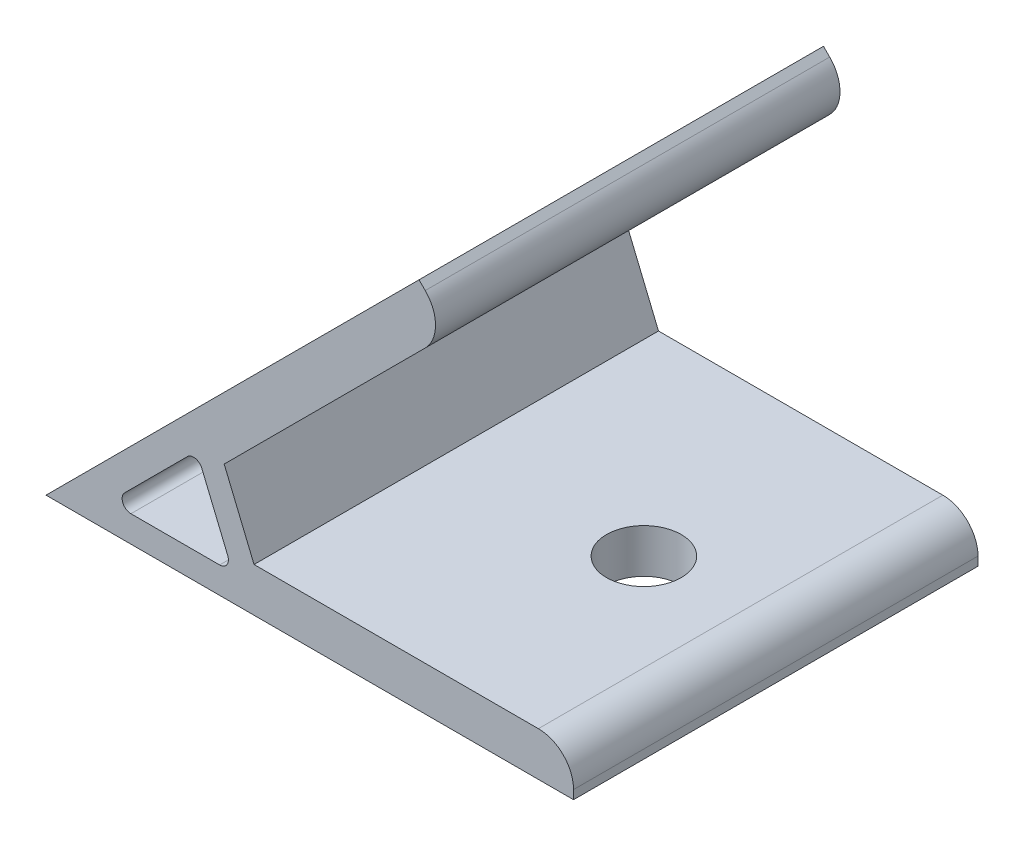
ISO-10303-21;
HEADER;
FILE_DESCRIPTION(('STEP AP214'),'2;1');
FILE_NAME('part.step','',(''),(''),'','','');
FILE_SCHEMA(('AUTOMOTIVE_DESIGN { 1 0 10303 214 1 1 1 1 }'));
ENDSEC;
DATA;
#1=APPLICATION_CONTEXT('core data for automotive mechanical design processes');
#2=APPLICATION_PROTOCOL_DEFINITION('international standard','automotive_design',2000,#1);
#3=PRODUCT_CONTEXT('',#1,'mechanical');
#4=PRODUCT('Part','Part','',(#3));
#5=PRODUCT_RELATED_PRODUCT_CATEGORY('part','',(#4));
#6=PRODUCT_DEFINITION_FORMATION('','',#4);
#7=PRODUCT_DEFINITION_CONTEXT('part definition',#1,'design');
#8=PRODUCT_DEFINITION('design','',#6,#7);
#9=PRODUCT_DEFINITION_SHAPE('','',#8);
#10=(LENGTH_UNIT() NAMED_UNIT(*) SI_UNIT(.MILLI.,.METRE.));
#11=(NAMED_UNIT(*) PLANE_ANGLE_UNIT() SI_UNIT($,.RADIAN.));
#12=(NAMED_UNIT(*) SI_UNIT($,.STERADIAN.) SOLID_ANGLE_UNIT());
#13=UNCERTAINTY_MEASURE_WITH_UNIT(LENGTH_MEASURE(1.E-05),#10,'distance_accuracy_value','');
#14=(GEOMETRIC_REPRESENTATION_CONTEXT(3) GLOBAL_UNCERTAINTY_ASSIGNED_CONTEXT((#13)) GLOBAL_UNIT_ASSIGNED_CONTEXT((#10,
#11,#12)) REPRESENTATION_CONTEXT('',''));
#15=CARTESIAN_POINT('',(0.,0.,0.));
#16=DIRECTION('',(0.,0.,1.));
#17=DIRECTION('',(1.,0.,0.));
#18=AXIS2_PLACEMENT_3D('',#15,#16,#17);
#19=CARTESIAN_POINT('',(0.,0.,23.));
#20=DIRECTION('',(0.,0.,1.));
#21=DIRECTION('',(1.,0.,0.));
#22=AXIS2_PLACEMENT_3D('',#19,#20,#21);
#23=PLANE('',#22);
#24=DIRECTION('',(0.,1.,0.));
#25=VECTOR('',#24,1.);
#26=CARTESIAN_POINT('',(60.,5.,23.));
#27=LINE('',#26,#25);
#28=CARTESIAN_POINT('',(60.,0.,23.));
#29=VERTEX_POINT('',#28);
#30=CARTESIAN_POINT('',(60.,1.,23.));
#31=VERTEX_POINT('',#30);
#32=EDGE_CURVE('E142',#29,#31,#27,.T.);
#33=ORIENTED_EDGE('',*,*,#32,.T.);
#34=CARTESIAN_POINT('',(56.,1.,23.));
#35=DIRECTION('',(0.,0.,1.));
#36=DIRECTION('',(1.,0.,0.));
#37=AXIS2_PLACEMENT_3D('',#34,#35,#36);
#38=CIRCLE('',#37,4.);
#39=CARTESIAN_POINT('',(56.,5.,23.));
#40=VERTEX_POINT('',#39);
#41=EDGE_CURVE('E184',#31,#40,#38,.T.);
#42=ORIENTED_EDGE('',*,*,#41,.T.);
#43=DIRECTION('',(-1.,0.,0.));
#44=VECTOR('',#43,1.);
#45=CARTESIAN_POINT('',(23.6613901632503,5.,23.));
#46=LINE('',#45,#44);
#47=CARTESIAN_POINT('',(23.6613901632503,5.,23.));
#48=VERTEX_POINT('',#47);
#49=EDGE_CURVE('E153',#40,#48,#46,.T.);
#50=ORIENTED_EDGE('',*,*,#49,.T.);
#51=DIRECTION('',(-0.382683432365087,0.923879532511288,0.));
#52=VECTOR('',#51,1.);
#53=CARTESIAN_POINT('',(20.2666633426678,13.1955955308021,23.));
#54=LINE('',#53,#52);
#55=CARTESIAN_POINT('',(20.2666633426678,13.1955955308021,23.));
#56=VERTEX_POINT('',#55);
#57=EDGE_CURVE('E244',#48,#56,#54,.T.);
#58=ORIENTED_EDGE('',*,*,#57,.T.);
#59=DIRECTION('',(0.707106781186551,0.707106781186544,0.));
#60=VECTOR('',#59,1.);
#61=CARTESIAN_POINT('',(45.9619407771258,38.8908729652599,23.));
#62=LINE('',#61,#60);
#63=CARTESIAN_POINT('',(43.1335136523796,36.0624458405137,23.));
#64=VERTEX_POINT('',#63);
#65=EDGE_CURVE('E246',#56,#64,#62,.T.);
#66=ORIENTED_EDGE('',*,*,#65,.T.);
#67=CARTESIAN_POINT('',(40.3050865276334,38.8908729652599,23.));
#68=DIRECTION('',(0.,0.,1.));
#69=DIRECTION('',(1.,0.,0.));
#70=AXIS2_PLACEMENT_3D('',#67,#68,#69);
#71=CIRCLE('',#70,4.);
#72=CARTESIAN_POINT('',(43.1335136523796,41.7193000900061,23.));
#73=VERTEX_POINT('',#72);
#74=EDGE_CURVE('E182',#64,#73,#71,.T.);
#75=ORIENTED_EDGE('',*,*,#74,.T.);
#76=DIRECTION('',(-0.707106781186543,0.707106781186552,0.));
#77=VECTOR('',#76,1.);
#78=CARTESIAN_POINT('',(42.4264068711931,42.4264068711926,23.));
#79=LINE('',#78,#77);
#80=CARTESIAN_POINT('',(42.4264068711931,42.4264068711926,23.));
#81=VERTEX_POINT('',#80);
#82=EDGE_CURVE('E249',#73,#81,#79,.T.);
#83=ORIENTED_EDGE('',*,*,#82,.T.);
#84=DIRECTION('',(-0.707106781186551,-0.707106781186544,0.));
#85=VECTOR('',#84,1.);
#86=CARTESIAN_POINT('',(0.,0.,23.));
#87=LINE('',#86,#85);
#88=CARTESIAN_POINT('',(0.,0.,23.));
#89=VERTEX_POINT('',#88);
#90=EDGE_CURVE('E158',#81,#89,#87,.T.);
#91=ORIENTED_EDGE('',*,*,#90,.T.);
#92=DIRECTION('',(1.,0.,0.));
#93=VECTOR('',#92,1.);
#94=CARTESIAN_POINT('',(60.,0.,23.));
#95=LINE('',#94,#93);
#96=EDGE_CURVE('E154',#89,#29,#95,.T.);
#97=ORIENTED_EDGE('',*,*,#96,.T.);
#98=EDGE_LOOP('',(#33,#42,#50,#58,#66,#75,#83,#91,#97));
#99=FACE_BOUND('',#98,.T.);
#100=DIRECTION('',(1.,0.,0.));
#101=VECTOR('',#100,1.);
#102=CARTESIAN_POINT('',(21.2426406871194,3.,23.));
#103=LINE('',#102,#101);
#104=CARTESIAN_POINT('',(9.65685424949248,3.,23.));
#105=VERTEX_POINT('',#104);
#106=CARTESIAN_POINT('',(19.7460349244539,3.,23.));
#107=VERTEX_POINT('',#106);
#108=EDGE_CURVE('E229',#105,#107,#103,.T.);
#109=ORIENTED_EDGE('',*,*,#108,.F.);
#110=CARTESIAN_POINT('',(9.65685424949247,4.,23.));
#111=DIRECTION('',(0.,0.,1.));
#112=DIRECTION('',(1.,0.,0.));
#113=AXIS2_PLACEMENT_3D('',#110,#111,#112);
#114=CIRCLE('',#113,1.);
#115=CARTESIAN_POINT('',(8.94974746830593,4.70710678118655,23.));
#116=VERTEX_POINT('',#115);
#117=EDGE_CURVE('E211',#105,#116,#114,.F.);
#118=ORIENTED_EDGE('',*,*,#117,.T.);
#119=DIRECTION('',(-0.707106781186551,-0.707106781186544,0.));
#120=VECTOR('',#119,1.);
#121=CARTESIAN_POINT('',(7.24264068711936,3.,23.));
#122=LINE('',#121,#120);
#123=CARTESIAN_POINT('',(16.0838755401874,11.841234853068,23.));
#124=VERTEX_POINT('',#123);
#125=EDGE_CURVE('E226',#124,#116,#122,.T.);
#126=ORIENTED_EDGE('',*,*,#125,.F.);
#127=CARTESIAN_POINT('',(16.790982321374,11.1341280718814,23.));
#128=DIRECTION('',(0.,0.,1.));
#129=DIRECTION('',(1.,0.,0.));
#130=AXIS2_PLACEMENT_3D('',#127,#128,#129);
#131=CIRCLE('',#130,1.);
#132=CARTESIAN_POINT('',(17.7148618538853,11.5168115042465,23.));
#133=VERTEX_POINT('',#132);
#134=EDGE_CURVE('E207',#124,#133,#131,.F.);
#135=ORIENTED_EDGE('',*,*,#134,.T.);
#136=DIRECTION('',(-0.382683432365087,0.923879532511288,0.));
#137=VECTOR('',#136,1.);
#138=CARTESIAN_POINT('',(17.1421356237311,12.8994949366116,23.));
#139=LINE('',#138,#137);
#140=CARTESIAN_POINT('',(20.6699144569652,4.38268343236509,23.));
#141=VERTEX_POINT('',#140);
#142=EDGE_CURVE('E231',#141,#133,#139,.T.);
#143=ORIENTED_EDGE('',*,*,#142,.F.);
#144=CARTESIAN_POINT('',(19.7460349244539,4.,23.));
#145=DIRECTION('',(0.,0.,1.));
#146=DIRECTION('',(1.,0.,0.));
#147=AXIS2_PLACEMENT_3D('',#144,#145,#146);
#148=CIRCLE('',#147,1.);
#149=EDGE_CURVE('E11',#141,#107,#148,.F.);
#150=ORIENTED_EDGE('',*,*,#149,.T.);
#151=EDGE_LOOP('',(#109,#118,#126,#135,#143,#150));
#152=FACE_BOUND('',#151,.T.);
#153=ADVANCED_FACE('F35',(#99,#152),#23,.T.);
#154=CARTESIAN_POINT('',(0.,0.,-23.));
#155=DIRECTION('',(0.,0.,1.));
#156=DIRECTION('',(1.,0.,0.));
#157=AXIS2_PLACEMENT_3D('',#154,#155,#156);
#158=PLANE('',#157);
#159=DIRECTION('',(-1.,0.,0.));
#160=VECTOR('',#159,1.);
#161=CARTESIAN_POINT('',(23.6613901632503,5.,-23.));
#162=LINE('',#161,#160);
#163=CARTESIAN_POINT('',(56.,5.,-23.));
#164=VERTEX_POINT('',#163);
#165=CARTESIAN_POINT('',(23.6613901632503,5.,-23.));
#166=VERTEX_POINT('',#165);
#167=EDGE_CURVE('E256',#164,#166,#162,.T.);
#168=ORIENTED_EDGE('',*,*,#167,.F.);
#169=CARTESIAN_POINT('',(56.,1.,-23.));
#170=DIRECTION('',(0.,0.,1.));
#171=DIRECTION('',(1.,0.,0.));
#172=AXIS2_PLACEMENT_3D('',#169,#170,#171);
#173=CIRCLE('',#172,4.);
#174=CARTESIAN_POINT('',(60.,1.,-23.));
#175=VERTEX_POINT('',#174);
#176=EDGE_CURVE('E179',#164,#175,#173,.F.);
#177=ORIENTED_EDGE('',*,*,#176,.T.);
#178=DIRECTION('',(0.,1.,0.));
#179=VECTOR('',#178,1.);
#180=CARTESIAN_POINT('',(60.,5.,-23.));
#181=LINE('',#180,#179);
#182=CARTESIAN_POINT('',(60.,0.,-23.));
#183=VERTEX_POINT('',#182);
#184=EDGE_CURVE('E254',#183,#175,#181,.T.);
#185=ORIENTED_EDGE('',*,*,#184,.F.);
#186=DIRECTION('',(1.,0.,0.));
#187=VECTOR('',#186,1.);
#188=CARTESIAN_POINT('',(60.,0.,-23.));
#189=LINE('',#188,#187);
#190=CARTESIAN_POINT('',(0.,0.,-23.));
#191=VERTEX_POINT('',#190);
#192=EDGE_CURVE('E166',#191,#183,#189,.T.);
#193=ORIENTED_EDGE('',*,*,#192,.F.);
#194=DIRECTION('',(-0.707106781186551,-0.707106781186544,0.));
#195=VECTOR('',#194,1.);
#196=CARTESIAN_POINT('',(0.,0.,-23.));
#197=LINE('',#196,#195);
#198=CARTESIAN_POINT('',(42.4264068711931,42.4264068711926,-23.));
#199=VERTEX_POINT('',#198);
#200=EDGE_CURVE('E162',#199,#191,#197,.T.);
#201=ORIENTED_EDGE('',*,*,#200,.F.);
#202=DIRECTION('',(-0.707106781186543,0.707106781186552,0.));
#203=VECTOR('',#202,1.);
#204=CARTESIAN_POINT('',(42.4264068711931,42.4264068711926,-23.));
#205=LINE('',#204,#203);
#206=CARTESIAN_POINT('',(43.1335136523796,41.7193000900061,-23.));
#207=VERTEX_POINT('',#206);
#208=EDGE_CURVE('E263',#207,#199,#205,.T.);
#209=ORIENTED_EDGE('',*,*,#208,.F.);
#210=CARTESIAN_POINT('',(40.3050865276334,38.8908729652599,-23.));
#211=DIRECTION('',(0.,0.,1.));
#212=DIRECTION('',(1.,0.,0.));
#213=AXIS2_PLACEMENT_3D('',#210,#211,#212);
#214=CIRCLE('',#213,4.);
#215=CARTESIAN_POINT('',(43.1335136523796,36.0624458405137,-23.));
#216=VERTEX_POINT('',#215);
#217=EDGE_CURVE('E171',#207,#216,#214,.F.);
#218=ORIENTED_EDGE('',*,*,#217,.T.);
#219=DIRECTION('',(0.707106781186551,0.707106781186544,0.));
#220=VECTOR('',#219,1.);
#221=CARTESIAN_POINT('',(45.9619407771258,38.8908729652599,-23.));
#222=LINE('',#221,#220);
#223=CARTESIAN_POINT('',(20.2666633426678,13.1955955308021,-23.));
#224=VERTEX_POINT('',#223);
#225=EDGE_CURVE('E260',#224,#216,#222,.T.);
#226=ORIENTED_EDGE('',*,*,#225,.F.);
#227=DIRECTION('',(-0.382683432365087,0.923879532511288,0.));
#228=VECTOR('',#227,1.);
#229=CARTESIAN_POINT('',(20.2666633426678,13.1955955308021,-23.));
#230=LINE('',#229,#228);
#231=EDGE_CURVE('E258',#166,#224,#230,.T.);
#232=ORIENTED_EDGE('',*,*,#231,.F.);
#233=EDGE_LOOP('',(#168,#177,#185,#193,#201,#209,#218,#226,#232));
#234=FACE_BOUND('',#233,.T.);
#235=DIRECTION('',(-0.382683432365087,0.923879532511288,0.));
#236=VECTOR('',#235,1.);
#237=CARTESIAN_POINT('',(17.1421356237311,12.8994949366116,-23.));
#238=LINE('',#237,#236);
#239=CARTESIAN_POINT('',(20.6699144569652,4.38268343236509,-23.));
#240=VERTEX_POINT('',#239);
#241=CARTESIAN_POINT('',(17.7148618538853,11.5168115042465,-23.));
#242=VERTEX_POINT('',#241);
#243=EDGE_CURVE('E217',#240,#242,#238,.T.);
#244=ORIENTED_EDGE('',*,*,#243,.T.);
#245=CARTESIAN_POINT('',(16.790982321374,11.1341280718814,-23.));
#246=DIRECTION('',(0.,0.,1.));
#247=DIRECTION('',(1.,0.,0.));
#248=AXIS2_PLACEMENT_3D('',#245,#246,#247);
#249=CIRCLE('',#248,1.);
#250=CARTESIAN_POINT('',(16.0838755401874,11.841234853068,-23.));
#251=VERTEX_POINT('',#250);
#252=EDGE_CURVE('E205',#242,#251,#249,.T.);
#253=ORIENTED_EDGE('',*,*,#252,.T.);
#254=DIRECTION('',(-0.707106781186551,-0.707106781186544,0.));
#255=VECTOR('',#254,1.);
#256=CARTESIAN_POINT('',(7.24264068711936,3.,-23.));
#257=LINE('',#256,#255);
#258=CARTESIAN_POINT('',(8.94974746830593,4.70710678118655,-23.));
#259=VERTEX_POINT('',#258);
#260=EDGE_CURVE('E238',#251,#259,#257,.T.);
#261=ORIENTED_EDGE('',*,*,#260,.T.);
#262=CARTESIAN_POINT('',(9.65685424949247,4.,-23.));
#263=DIRECTION('',(0.,0.,1.));
#264=DIRECTION('',(1.,0.,0.));
#265=AXIS2_PLACEMENT_3D('',#262,#263,#264);
#266=CIRCLE('',#265,1.);
#267=CARTESIAN_POINT('',(9.65685424949248,3.,-23.));
#268=VERTEX_POINT('',#267);
#269=EDGE_CURVE('E209',#259,#268,#266,.T.);
#270=ORIENTED_EDGE('',*,*,#269,.T.);
#271=DIRECTION('',(1.,0.,0.));
#272=VECTOR('',#271,1.);
#273=CARTESIAN_POINT('',(21.2426406871194,3.,-23.));
#274=LINE('',#273,#272);
#275=CARTESIAN_POINT('',(19.7460349244539,3.,-23.));
#276=VERTEX_POINT('',#275);
#277=EDGE_CURVE('E218',#268,#276,#274,.T.);
#278=ORIENTED_EDGE('',*,*,#277,.T.);
#279=CARTESIAN_POINT('',(19.7460349244539,4.,-23.));
#280=DIRECTION('',(0.,0.,1.));
#281=DIRECTION('',(1.,0.,0.));
#282=AXIS2_PLACEMENT_3D('',#279,#280,#281);
#283=CIRCLE('',#282,1.);
#284=EDGE_CURVE('E43',#276,#240,#283,.T.);
#285=ORIENTED_EDGE('',*,*,#284,.T.);
#286=EDGE_LOOP('',(#244,#253,#261,#270,#278,#285));
#287=FACE_BOUND('',#286,.T.);
#288=ADVANCED_FACE('F216',(#234,#287),#158,.F.);
#289=CARTESIAN_POINT('',(60.,0.,23.));
#290=DIRECTION('',(0.,1.,0.));
#291=DIRECTION('',(0.,0.,1.));
#292=AXIS2_PLACEMENT_3D('',#289,#290,#291);
#293=PLANE('',#292);
#294=CARTESIAN_POINT('',(45.,0.,0.));
#295=DIRECTION('',(0.,-1.,0.));
#296=DIRECTION('',(0.,0.,-1.));
#297=AXIS2_PLACEMENT_3D('',#294,#295,#296);
#298=CIRCLE('',#297,4.25000000000001);
#299=CARTESIAN_POINT('',(45.,0.,-4.25000000000001));
#300=VERTEX_POINT('',#299);
#301=EDGE_CURVE('E343',#300,#300,#298,.T.);
#302=ORIENTED_EDGE('',*,*,#301,.F.);
#303=EDGE_LOOP('',(#302));
#304=FACE_BOUND('',#303,.T.);
#305=ORIENTED_EDGE('',*,*,#192,.T.);
#306=DIRECTION('',(0.,0.,-1.));
#307=VECTOR('',#306,1.);
#308=CARTESIAN_POINT('',(60.,0.,23.));
#309=LINE('',#308,#307);
#310=EDGE_CURVE('E147',#29,#183,#309,.T.);
#311=ORIENTED_EDGE('',*,*,#310,.F.);
#312=ORIENTED_EDGE('',*,*,#96,.F.);
#313=DIRECTION('',(0.,0.,-1.));
#314=VECTOR('',#313,1.);
#315=CARTESIAN_POINT('',(0.,0.,23.));
#316=LINE('',#315,#314);
#317=EDGE_CURVE('E252',#89,#191,#316,.T.);
#318=ORIENTED_EDGE('',*,*,#317,.T.);
#319=EDGE_LOOP('',(#305,#311,#312,#318));
#320=FACE_BOUND('',#319,.T.);
#321=ADVANCED_FACE('F164',(#304,#320),#293,.F.);
#322=CARTESIAN_POINT('',(60.,5.,23.));
#323=DIRECTION('',(-1.,0.,0.));
#324=DIRECTION('',(0.,0.,1.));
#325=AXIS2_PLACEMENT_3D('',#322,#323,#324);
#326=PLANE('',#325);
#327=ORIENTED_EDGE('',*,*,#184,.T.);
#328=DIRECTION('',(0.,0.,-1.));
#329=VECTOR('',#328,1.);
#330=CARTESIAN_POINT('',(60.,1.,23.));
#331=LINE('',#330,#329);
#332=EDGE_CURVE('E150',#175,#31,#331,.F.);
#333=ORIENTED_EDGE('',*,*,#332,.T.);
#334=ORIENTED_EDGE('',*,*,#32,.F.);
#335=ORIENTED_EDGE('',*,*,#310,.T.);
#336=EDGE_LOOP('',(#327,#333,#334,#335));
#337=FACE_BOUND('',#336,.T.);
#338=ADVANCED_FACE('F145',(#337),#326,.F.);
#339=CARTESIAN_POINT('',(23.6613901632503,5.,23.));
#340=DIRECTION('',(0.,-1.,0.));
#341=DIRECTION('',(0.,0.,-1.));
#342=AXIS2_PLACEMENT_3D('',#339,#340,#341);
#343=PLANE('',#342);
#344=CARTESIAN_POINT('',(45.,5.,0.));
#345=DIRECTION('',(0.,-1.,0.));
#346=DIRECTION('',(0.,0.,-1.));
#347=AXIS2_PLACEMENT_3D('',#344,#345,#346);
#348=CIRCLE('',#347,4.25000000000001);
#349=CARTESIAN_POINT('',(45.,5.,-4.25000000000001));
#350=VERTEX_POINT('',#349);
#351=EDGE_CURVE('E345',#350,#350,#348,.F.);
#352=ORIENTED_EDGE('',*,*,#351,.F.);
#353=EDGE_LOOP('',(#352));
#354=FACE_BOUND('',#353,.T.);
#355=ORIENTED_EDGE('',*,*,#49,.F.);
#356=DIRECTION('',(0.,0.,-1.));
#357=VECTOR('',#356,1.);
#358=CARTESIAN_POINT('',(56.,5.,23.));
#359=LINE('',#358,#357);
#360=EDGE_CURVE('E167',#40,#164,#359,.T.);
#361=ORIENTED_EDGE('',*,*,#360,.T.);
#362=ORIENTED_EDGE('',*,*,#167,.T.);
#363=DIRECTION('',(0.,0.,-1.));
#364=VECTOR('',#363,1.);
#365=CARTESIAN_POINT('',(23.6613901632503,5.,23.));
#366=LINE('',#365,#364);
#367=EDGE_CURVE('E168',#48,#166,#366,.T.);
#368=ORIENTED_EDGE('',*,*,#367,.F.);
#369=EDGE_LOOP('',(#355,#361,#362,#368));
#370=FACE_BOUND('',#369,.T.);
#371=ADVANCED_FACE('F295',(#354,#370),#343,.F.);
#372=CARTESIAN_POINT('',(20.2666633426678,13.1955955308021,23.));
#373=DIRECTION('',(-0.923879532511288,-0.382683432365087,0.));
#374=DIRECTION('',(0.382683432365087,-0.923879532511288,0.));
#375=AXIS2_PLACEMENT_3D('',#372,#373,#374);
#376=PLANE('',#375);
#377=ORIENTED_EDGE('',*,*,#231,.T.);
#378=DIRECTION('',(0.,0.,-1.));
#379=VECTOR('',#378,1.);
#380=CARTESIAN_POINT('',(20.2666633426678,13.1955955308021,23.));
#381=LINE('',#380,#379);
#382=EDGE_CURVE('E174',#56,#224,#381,.T.);
#383=ORIENTED_EDGE('',*,*,#382,.F.);
#384=ORIENTED_EDGE('',*,*,#57,.F.);
#385=ORIENTED_EDGE('',*,*,#367,.T.);
#386=EDGE_LOOP('',(#377,#383,#384,#385));
#387=FACE_BOUND('',#386,.T.);
#388=ADVANCED_FACE('F293',(#387),#376,.F.);
#389=CARTESIAN_POINT('',(45.9619407771258,38.8908729652599,23.));
#390=DIRECTION('',(-0.707106781186544,0.707106781186551,0.));
#391=DIRECTION('',(-0.707106781186551,-0.707106781186544,0.));
#392=AXIS2_PLACEMENT_3D('',#389,#390,#391);
#393=PLANE('',#392);
#394=CARTESIAN_POINT('',(35.3553390593275,28.2842712474617,0.));
#395=DIRECTION('',(-0.707106781186544,0.707106781186551,0.));
#396=DIRECTION('',(-0.707106781186551,-0.707106781186544,0.));
#397=AXIS2_PLACEMENT_3D('',#394,#395,#396);
#398=CIRCLE('',#397,4.25);
#399=CARTESIAN_POINT('',(32.3501352392847,25.2790674274189,0.));
#400=VERTEX_POINT('',#399);
#401=EDGE_CURVE('E241',#400,#400,#398,.F.);
#402=ORIENTED_EDGE('',*,*,#401,.F.);
#403=EDGE_LOOP('',(#402));
#404=FACE_BOUND('',#403,.T.);
#405=ORIENTED_EDGE('',*,*,#225,.T.);
#406=DIRECTION('',(0.,0.,-1.));
#407=VECTOR('',#406,1.);
#408=CARTESIAN_POINT('',(43.1335136523796,36.0624458405137,23.));
#409=LINE('',#408,#407);
#410=EDGE_CURVE('E189',#216,#64,#409,.F.);
#411=ORIENTED_EDGE('',*,*,#410,.T.);
#412=ORIENTED_EDGE('',*,*,#65,.F.);
#413=ORIENTED_EDGE('',*,*,#382,.T.);
#414=EDGE_LOOP('',(#405,#411,#412,#413));
#415=FACE_BOUND('',#414,.T.);
#416=ADVANCED_FACE('F274',(#404,#415),#393,.F.);
#417=CARTESIAN_POINT('',(42.4264068711931,42.4264068711926,23.));
#418=DIRECTION('',(-0.707106781186552,-0.707106781186543,0.));
#419=DIRECTION('',(0.707106781186543,-0.707106781186552,0.));
#420=AXIS2_PLACEMENT_3D('',#417,#418,#419);
#421=PLANE('',#420);
#422=ORIENTED_EDGE('',*,*,#82,.F.);
#423=DIRECTION('',(0.,0.,-1.));
#424=VECTOR('',#423,1.);
#425=CARTESIAN_POINT('',(43.1335136523796,41.7193000900061,23.));
#426=LINE('',#425,#424);
#427=EDGE_CURVE('E186',#73,#207,#426,.T.);
#428=ORIENTED_EDGE('',*,*,#427,.T.);
#429=ORIENTED_EDGE('',*,*,#208,.T.);
#430=DIRECTION('',(0.,0.,-1.));
#431=VECTOR('',#430,1.);
#432=CARTESIAN_POINT('',(42.4264068711931,42.4264068711926,23.));
#433=LINE('',#432,#431);
#434=EDGE_CURVE('E267',#81,#199,#433,.T.);
#435=ORIENTED_EDGE('',*,*,#434,.F.);
#436=EDGE_LOOP('',(#422,#428,#429,#435));
#437=FACE_BOUND('',#436,.T.);
#438=ADVANCED_FACE('F289',(#437),#421,.F.);
#439=CARTESIAN_POINT('',(0.,0.,23.));
#440=DIRECTION('',(0.707106781186544,-0.707106781186551,0.));
#441=DIRECTION('',(0.707106781186551,0.707106781186544,0.));
#442=AXIS2_PLACEMENT_3D('',#439,#440,#441);
#443=PLANE('',#442);
#444=CARTESIAN_POINT('',(31.8198051533948,31.8198051533945,0.));
#445=DIRECTION('',(-0.707106781186544,0.707106781186551,0.));
#446=DIRECTION('',(-0.707106781186551,-0.707106781186544,0.));
#447=AXIS2_PLACEMENT_3D('',#444,#445,#446);
#448=CIRCLE('',#447,4.25);
#449=CARTESIAN_POINT('',(28.814601333352,28.8146013333516,0.));
#450=VERTEX_POINT('',#449);
#451=EDGE_CURVE('E348',#450,#450,#448,.T.);
#452=ORIENTED_EDGE('',*,*,#451,.F.);
#453=EDGE_LOOP('',(#452));
#454=FACE_BOUND('',#453,.T.);
#455=ORIENTED_EDGE('',*,*,#200,.T.);
#456=ORIENTED_EDGE('',*,*,#317,.F.);
#457=ORIENTED_EDGE('',*,*,#90,.F.);
#458=ORIENTED_EDGE('',*,*,#434,.T.);
#459=EDGE_LOOP('',(#455,#456,#457,#458));
#460=FACE_BOUND('',#459,.T.);
#461=ADVANCED_FACE('F322',(#454,#460),#443,.F.);
#462=CARTESIAN_POINT('',(7.24264068711936,3.,23.));
#463=DIRECTION('',(0.707106781186544,-0.707106781186551,0.));
#464=DIRECTION('',(0.707106781186551,0.707106781186544,0.));
#465=AXIS2_PLACEMENT_3D('',#462,#463,#464);
#466=PLANE('',#465);
#467=ORIENTED_EDGE('',*,*,#260,.F.);
#468=DIRECTION('',(0.,0.,-1.));
#469=VECTOR('',#468,1.);
#470=CARTESIAN_POINT('',(16.0838755401874,11.841234853068,23.));
#471=LINE('',#470,#469);
#472=EDGE_CURVE('E199',#251,#124,#471,.F.);
#473=ORIENTED_EDGE('',*,*,#472,.T.);
#474=ORIENTED_EDGE('',*,*,#125,.T.);
#475=DIRECTION('',(0.,0.,-1.));
#476=VECTOR('',#475,1.);
#477=CARTESIAN_POINT('',(8.94974746830593,4.70710678118655,-23.));
#478=LINE('',#477,#476);
#479=EDGE_CURVE('E196',#116,#259,#478,.T.);
#480=ORIENTED_EDGE('',*,*,#479,.T.);
#481=EDGE_LOOP('',(#467,#473,#474,#480));
#482=FACE_BOUND('',#481,.T.);
#483=ADVANCED_FACE('F319',(#482),#466,.T.);
#484=CARTESIAN_POINT('',(21.2426406871194,3.,23.));
#485=DIRECTION('',(0.,1.,0.));
#486=DIRECTION('',(0.,0.,1.));
#487=AXIS2_PLACEMENT_3D('',#484,#485,#486);
#488=PLANE('',#487);
#489=ORIENTED_EDGE('',*,*,#277,.F.);
#490=DIRECTION('',(0.,0.,-1.));
#491=VECTOR('',#490,1.);
#492=CARTESIAN_POINT('',(9.65685424949247,3.,23.));
#493=LINE('',#492,#491);
#494=EDGE_CURVE('E55',#268,#105,#493,.F.);
#495=ORIENTED_EDGE('',*,*,#494,.T.);
#496=ORIENTED_EDGE('',*,*,#108,.T.);
#497=DIRECTION('',(0.,0.,-1.));
#498=VECTOR('',#497,1.);
#499=CARTESIAN_POINT('',(19.7460349244539,3.,-23.));
#500=LINE('',#499,#498);
#501=EDGE_CURVE('E201',#107,#276,#500,.T.);
#502=ORIENTED_EDGE('',*,*,#501,.T.);
#503=EDGE_LOOP('',(#489,#495,#496,#502));
#504=FACE_BOUND('',#503,.T.);
#505=ADVANCED_FACE('F228',(#504),#488,.T.);
#506=CARTESIAN_POINT('',(17.1421356237311,12.8994949366116,23.));
#507=DIRECTION('',(-0.923879532511288,-0.382683432365087,0.));
#508=DIRECTION('',(0.382683432365087,-0.923879532511288,0.));
#509=AXIS2_PLACEMENT_3D('',#506,#507,#508);
#510=PLANE('',#509);
#511=ORIENTED_EDGE('',*,*,#142,.T.);
#512=DIRECTION('',(0.,0.,-1.));
#513=VECTOR('',#512,1.);
#514=CARTESIAN_POINT('',(17.7148618538853,11.5168115042465,-23.));
#515=LINE('',#514,#513);
#516=EDGE_CURVE('E193',#133,#242,#515,.T.);
#517=ORIENTED_EDGE('',*,*,#516,.T.);
#518=ORIENTED_EDGE('',*,*,#243,.F.);
#519=DIRECTION('',(0.,0.,-1.));
#520=VECTOR('',#519,1.);
#521=CARTESIAN_POINT('',(20.6699144569652,4.38268343236509,23.));
#522=LINE('',#521,#520);
#523=EDGE_CURVE('E191',#240,#141,#522,.F.);
#524=ORIENTED_EDGE('',*,*,#523,.T.);
#525=EDGE_LOOP('',(#511,#517,#518,#524));
#526=FACE_BOUND('',#525,.T.);
#527=ADVANCED_FACE('F224',(#526),#510,.T.);
#528=CARTESIAN_POINT('',(43.8553390593275,19.7842712474617,0.));
#529=DIRECTION('',(-0.707106781186544,0.707106781186551,0.));
#530=DIRECTION('',(-0.707106781186551,-0.707106781186544,0.));
#531=AXIS2_PLACEMENT_3D('',#528,#529,#530);
#532=CYLINDRICAL_SURFACE('',#531,4.25);
#533=ORIENTED_EDGE('',*,*,#401,.T.);
#534=EDGE_LOOP('',(#533));
#535=FACE_BOUND('',#534,.T.);
#536=ORIENTED_EDGE('',*,*,#451,.T.);
#537=EDGE_LOOP('',(#536));
#538=FACE_BOUND('',#537,.T.);
#539=ADVANCED_FACE('F308',(#535,#538),#532,.F.);
#540=CARTESIAN_POINT('',(45.,17.0208152801713,0.));
#541=DIRECTION('',(0.,-1.,0.));
#542=DIRECTION('',(0.,0.,-1.));
#543=AXIS2_PLACEMENT_3D('',#540,#541,#542);
#544=CYLINDRICAL_SURFACE('',#543,4.25000000000001);
#545=ORIENTED_EDGE('',*,*,#351,.T.);
#546=EDGE_LOOP('',(#545));
#547=FACE_BOUND('',#546,.T.);
#548=ORIENTED_EDGE('',*,*,#301,.T.);
#549=EDGE_LOOP('',(#548));
#550=FACE_BOUND('',#549,.T.);
#551=ADVANCED_FACE('F300',(#547,#550),#544,.F.);
#552=CARTESIAN_POINT('',(56.,1.,23.));
#553=DIRECTION('',(0.,0.,-1.));
#554=DIRECTION('',(-1.,0.,0.));
#555=AXIS2_PLACEMENT_3D('',#552,#553,#554);
#556=CYLINDRICAL_SURFACE('',#555,4.);
#557=ORIENTED_EDGE('',*,*,#41,.F.);
#558=ORIENTED_EDGE('',*,*,#332,.F.);
#559=ORIENTED_EDGE('',*,*,#176,.F.);
#560=ORIENTED_EDGE('',*,*,#360,.F.);
#561=EDGE_LOOP('',(#557,#558,#559,#560));
#562=FACE_BOUND('',#561,.T.);
#563=ADVANCED_FACE('F298',(#562),#556,.T.);
#564=CARTESIAN_POINT('',(40.3050865276334,38.8908729652599,23.));
#565=DIRECTION('',(0.,0.,-1.));
#566=DIRECTION('',(-1.,0.,0.));
#567=AXIS2_PLACEMENT_3D('',#564,#565,#566);
#568=CYLINDRICAL_SURFACE('',#567,4.);
#569=ORIENTED_EDGE('',*,*,#74,.F.);
#570=ORIENTED_EDGE('',*,*,#410,.F.);
#571=ORIENTED_EDGE('',*,*,#217,.F.);
#572=ORIENTED_EDGE('',*,*,#427,.F.);
#573=EDGE_LOOP('',(#569,#570,#571,#572));
#574=FACE_BOUND('',#573,.T.);
#575=ADVANCED_FACE('F286',(#574),#568,.T.);
#576=CARTESIAN_POINT('',(16.790982321374,11.1341280718814,23.));
#577=DIRECTION('',(0.,0.,1.));
#578=DIRECTION('',(1.,0.,0.));
#579=AXIS2_PLACEMENT_3D('',#576,#577,#578);
#580=CYLINDRICAL_SURFACE('',#579,1.);
#581=ORIENTED_EDGE('',*,*,#134,.F.);
#582=ORIENTED_EDGE('',*,*,#472,.F.);
#583=ORIENTED_EDGE('',*,*,#252,.F.);
#584=ORIENTED_EDGE('',*,*,#516,.F.);
#585=EDGE_LOOP('',(#581,#582,#583,#584));
#586=FACE_BOUND('',#585,.T.);
#587=ADVANCED_FACE('F306',(#586),#580,.F.);
#588=CARTESIAN_POINT('',(9.65685424949247,4.,23.));
#589=DIRECTION('',(0.,0.,1.));
#590=DIRECTION('',(1.,0.,0.));
#591=AXIS2_PLACEMENT_3D('',#588,#589,#590);
#592=CYLINDRICAL_SURFACE('',#591,1.);
#593=ORIENTED_EDGE('',*,*,#117,.F.);
#594=ORIENTED_EDGE('',*,*,#494,.F.);
#595=ORIENTED_EDGE('',*,*,#269,.F.);
#596=ORIENTED_EDGE('',*,*,#479,.F.);
#597=EDGE_LOOP('',(#593,#594,#595,#596));
#598=FACE_BOUND('',#597,.T.);
#599=ADVANCED_FACE('F378',(#598),#592,.F.);
#600=CARTESIAN_POINT('',(19.7460349244539,4.,23.));
#601=DIRECTION('',(0.,0.,1.));
#602=DIRECTION('',(1.,0.,0.));
#603=AXIS2_PLACEMENT_3D('',#600,#601,#602);
#604=CYLINDRICAL_SURFACE('',#603,1.);
#605=ORIENTED_EDGE('',*,*,#149,.F.);
#606=ORIENTED_EDGE('',*,*,#523,.F.);
#607=ORIENTED_EDGE('',*,*,#284,.F.);
#608=ORIENTED_EDGE('',*,*,#501,.F.);
#609=EDGE_LOOP('',(#605,#606,#607,#608));
#610=FACE_BOUND('',#609,.T.);
#611=ADVANCED_FACE('F37',(#610),#604,.F.);
#612=CLOSED_SHELL('',(#153,#288,#321,#338,#371,#388,#416,#438,#461,#483,#505,#527,#539,#551,
#563,#575,#587,#599,#611));
#613=MANIFOLD_SOLID_BREP('B2',#612);
#614=ADVANCED_BREP_SHAPE_REPRESENTATION('',(#18,#613),#14);
#615=SHAPE_DEFINITION_REPRESENTATION(#9,#614);
ENDSEC;
END-ISO-10303-21;
